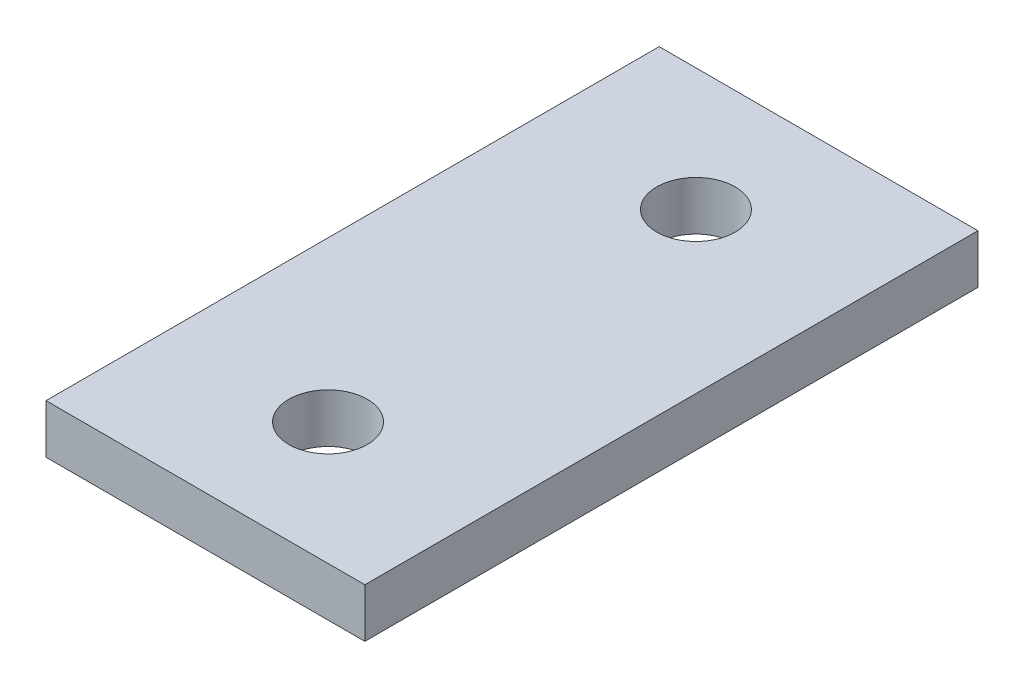
ISO-10303-21;
HEADER;
FILE_DESCRIPTION(('STEP AP214'),'2;1');
FILE_NAME('part.step','',(''),(''),'','','');
FILE_SCHEMA(('AUTOMOTIVE_DESIGN { 1 0 10303 214 1 1 1 1 }'));
ENDSEC;
DATA;
#1=APPLICATION_CONTEXT('core data for automotive mechanical design processes');
#2=APPLICATION_PROTOCOL_DEFINITION('international standard','automotive_design',2000,#1);
#3=PRODUCT_CONTEXT('',#1,'mechanical');
#4=PRODUCT('Part','Part','',(#3));
#5=PRODUCT_RELATED_PRODUCT_CATEGORY('part','',(#4));
#6=PRODUCT_DEFINITION_FORMATION('','',#4);
#7=PRODUCT_DEFINITION_CONTEXT('part definition',#1,'design');
#8=PRODUCT_DEFINITION('design','',#6,#7);
#9=PRODUCT_DEFINITION_SHAPE('','',#8);
#10=(LENGTH_UNIT() NAMED_UNIT(*) SI_UNIT(.MILLI.,.METRE.));
#11=(NAMED_UNIT(*) PLANE_ANGLE_UNIT() SI_UNIT($,.RADIAN.));
#12=(NAMED_UNIT(*) SI_UNIT($,.STERADIAN.) SOLID_ANGLE_UNIT());
#13=UNCERTAINTY_MEASURE_WITH_UNIT(LENGTH_MEASURE(1.E-05),#10,'distance_accuracy_value','');
#14=(GEOMETRIC_REPRESENTATION_CONTEXT(3) GLOBAL_UNCERTAINTY_ASSIGNED_CONTEXT((#13)) GLOBAL_UNIT_ASSIGNED_CONTEXT((#10,
#11,#12)) REPRESENTATION_CONTEXT('',''));
#15=CARTESIAN_POINT('',(0.,0.,0.));
#16=DIRECTION('',(0.,0.,1.));
#17=DIRECTION('',(1.,0.,0.));
#18=AXIS2_PLACEMENT_3D('',#15,#16,#17);
#19=CARTESIAN_POINT('',(0.,2.,0.));
#20=DIRECTION('',(0.,-1.,0.));
#21=DIRECTION('',(0.,0.,-1.));
#22=AXIS2_PLACEMENT_3D('',#19,#20,#21);
#23=PLANE('',#22);
#24=CARTESIAN_POINT('',(0.,2.,-7.5));
#25=DIRECTION('',(0.,1.,0.));
#26=DIRECTION('',(0.,0.,1.));
#27=AXIS2_PLACEMENT_3D('',#24,#25,#26);
#28=CIRCLE('',#27,1.6);
#29=CARTESIAN_POINT('',(0.,2.,-5.9));
#30=VERTEX_POINT('',#29);
#31=EDGE_CURVE('E101',#30,#30,#28,.T.);
#32=ORIENTED_EDGE('',*,*,#31,.F.);
#33=EDGE_LOOP('',(#32));
#34=FACE_BOUND('',#33,.T.);
#35=DIRECTION('',(0.,0.,-1.));
#36=VECTOR('',#35,1.);
#37=CARTESIAN_POINT('',(6.50000000000001,2.,12.5));
#38=LINE('',#37,#36);
#39=CARTESIAN_POINT('',(6.50000000000001,2.,12.5));
#40=VERTEX_POINT('',#39);
#41=CARTESIAN_POINT('',(6.5,2.,-12.5));
#42=VERTEX_POINT('',#41);
#43=EDGE_CURVE('E86',#40,#42,#38,.T.);
#44=ORIENTED_EDGE('',*,*,#43,.T.);
#45=DIRECTION('',(-1.,0.,0.));
#46=VECTOR('',#45,1.);
#47=CARTESIAN_POINT('',(-6.5,2.,-12.5));
#48=LINE('',#47,#46);
#49=CARTESIAN_POINT('',(-6.5,2.,-12.5));
#50=VERTEX_POINT('',#49);
#51=EDGE_CURVE('E81',#42,#50,#48,.T.);
#52=ORIENTED_EDGE('',*,*,#51,.T.);
#53=DIRECTION('',(0.,0.,1.));
#54=VECTOR('',#53,1.);
#55=CARTESIAN_POINT('',(-6.5,2.,12.5));
#56=LINE('',#55,#54);
#57=CARTESIAN_POINT('',(-6.5,2.,12.5));
#58=VERTEX_POINT('',#57);
#59=EDGE_CURVE('E84',#50,#58,#56,.T.);
#60=ORIENTED_EDGE('',*,*,#59,.T.);
#61=DIRECTION('',(1.,0.,0.));
#62=VECTOR('',#61,1.);
#63=CARTESIAN_POINT('',(-6.5,2.,12.5));
#64=LINE('',#63,#62);
#65=EDGE_CURVE('E51',#58,#40,#64,.T.);
#66=ORIENTED_EDGE('',*,*,#65,.T.);
#67=EDGE_LOOP('',(#44,#52,#60,#66));
#68=FACE_BOUND('',#67,.T.);
#69=CARTESIAN_POINT('',(0.,2.,7.5));
#70=DIRECTION('',(0.,1.,0.));
#71=DIRECTION('',(0.,0.,1.));
#72=AXIS2_PLACEMENT_3D('',#69,#70,#71);
#73=CIRCLE('',#72,1.6);
#74=CARTESIAN_POINT('',(0.,2.,9.1));
#75=VERTEX_POINT('',#74);
#76=EDGE_CURVE('E116',#75,#75,#73,.T.);
#77=ORIENTED_EDGE('',*,*,#76,.F.);
#78=EDGE_LOOP('',(#77));
#79=FACE_BOUND('',#78,.T.);
#80=ADVANCED_FACE('F34',(#34,#68,#79),#23,.F.);
#81=CARTESIAN_POINT('',(0.,0.,0.));
#82=DIRECTION('',(0.,-1.,0.));
#83=DIRECTION('',(0.,0.,-1.));
#84=AXIS2_PLACEMENT_3D('',#81,#82,#83);
#85=PLANE('',#84);
#86=CARTESIAN_POINT('',(0.,0.,-7.5));
#87=DIRECTION('',(0.,1.,0.));
#88=DIRECTION('',(0.,0.,1.));
#89=AXIS2_PLACEMENT_3D('',#86,#87,#88);
#90=CIRCLE('',#89,1.6);
#91=CARTESIAN_POINT('',(0.,0.,-5.9));
#92=VERTEX_POINT('',#91);
#93=EDGE_CURVE('E113',#92,#92,#90,.T.);
#94=ORIENTED_EDGE('',*,*,#93,.T.);
#95=EDGE_LOOP('',(#94));
#96=FACE_BOUND('',#95,.T.);
#97=DIRECTION('',(0.,0.,-1.));
#98=VECTOR('',#97,1.);
#99=CARTESIAN_POINT('',(6.50000000000001,0.,12.5));
#100=LINE('',#99,#98);
#101=CARTESIAN_POINT('',(6.50000000000001,0.,12.5));
#102=VERTEX_POINT('',#101);
#103=CARTESIAN_POINT('',(6.5,0.,-12.5));
#104=VERTEX_POINT('',#103);
#105=EDGE_CURVE('E98',#102,#104,#100,.T.);
#106=ORIENTED_EDGE('',*,*,#105,.F.);
#107=DIRECTION('',(1.,0.,0.));
#108=VECTOR('',#107,1.);
#109=CARTESIAN_POINT('',(-6.5,0.,12.5));
#110=LINE('',#109,#108);
#111=CARTESIAN_POINT('',(-6.5,0.,12.5));
#112=VERTEX_POINT('',#111);
#113=EDGE_CURVE('E74',#112,#102,#110,.T.);
#114=ORIENTED_EDGE('',*,*,#113,.F.);
#115=DIRECTION('',(0.,0.,1.));
#116=VECTOR('',#115,1.);
#117=CARTESIAN_POINT('',(-6.5,0.,12.5));
#118=LINE('',#117,#116);
#119=CARTESIAN_POINT('',(-6.5,0.,-12.5));
#120=VERTEX_POINT('',#119);
#121=EDGE_CURVE('E68',#120,#112,#118,.T.);
#122=ORIENTED_EDGE('',*,*,#121,.F.);
#123=DIRECTION('',(-1.,0.,0.));
#124=VECTOR('',#123,1.);
#125=CARTESIAN_POINT('',(-6.5,0.,-12.5));
#126=LINE('',#125,#124);
#127=EDGE_CURVE('E90',#104,#120,#126,.T.);
#128=ORIENTED_EDGE('',*,*,#127,.F.);
#129=EDGE_LOOP('',(#106,#114,#122,#128));
#130=FACE_BOUND('',#129,.T.);
#131=CARTESIAN_POINT('',(0.,0.,7.5));
#132=DIRECTION('',(0.,1.,0.));
#133=DIRECTION('',(0.,0.,1.));
#134=AXIS2_PLACEMENT_3D('',#131,#132,#133);
#135=CIRCLE('',#134,1.6);
#136=CARTESIAN_POINT('',(0.,0.,9.1));
#137=VERTEX_POINT('',#136);
#138=EDGE_CURVE('E119',#137,#137,#135,.T.);
#139=ORIENTED_EDGE('',*,*,#138,.T.);
#140=EDGE_LOOP('',(#139));
#141=FACE_BOUND('',#140,.T.);
#142=ADVANCED_FACE('F109',(#96,#130,#141),#85,.T.);
#143=CARTESIAN_POINT('',(6.50000000000001,2.,12.5));
#144=DIRECTION('',(-1.,0.,0.));
#145=DIRECTION('',(0.,0.,1.));
#146=AXIS2_PLACEMENT_3D('',#143,#144,#145);
#147=PLANE('',#146);
#148=ORIENTED_EDGE('',*,*,#105,.T.);
#149=DIRECTION('',(0.,-1.,0.));
#150=VECTOR('',#149,1.);
#151=CARTESIAN_POINT('',(6.5,2.,-12.5));
#152=LINE('',#151,#150);
#153=EDGE_CURVE('E11',#42,#104,#152,.T.);
#154=ORIENTED_EDGE('',*,*,#153,.F.);
#155=ORIENTED_EDGE('',*,*,#43,.F.);
#156=DIRECTION('',(0.,-1.,0.));
#157=VECTOR('',#156,1.);
#158=CARTESIAN_POINT('',(6.50000000000001,2.,12.5));
#159=LINE('',#158,#157);
#160=EDGE_CURVE('E94',#40,#102,#159,.T.);
#161=ORIENTED_EDGE('',*,*,#160,.T.);
#162=EDGE_LOOP('',(#148,#154,#155,#161));
#163=FACE_BOUND('',#162,.T.);
#164=ADVANCED_FACE('F36',(#163),#147,.F.);
#165=CARTESIAN_POINT('',(-6.5,2.,-12.5));
#166=DIRECTION('',(0.,0.,1.));
#167=DIRECTION('',(1.,0.,0.));
#168=AXIS2_PLACEMENT_3D('',#165,#166,#167);
#169=PLANE('',#168);
#170=ORIENTED_EDGE('',*,*,#127,.T.);
#171=DIRECTION('',(0.,-1.,0.));
#172=VECTOR('',#171,1.);
#173=CARTESIAN_POINT('',(-6.5,2.,-12.5));
#174=LINE('',#173,#172);
#175=EDGE_CURVE('E43',#50,#120,#174,.T.);
#176=ORIENTED_EDGE('',*,*,#175,.F.);
#177=ORIENTED_EDGE('',*,*,#51,.F.);
#178=ORIENTED_EDGE('',*,*,#153,.T.);
#179=EDGE_LOOP('',(#170,#176,#177,#178));
#180=FACE_BOUND('',#179,.T.);
#181=ADVANCED_FACE('F89',(#180),#169,.F.);
#182=CARTESIAN_POINT('',(-6.5,2.,12.5));
#183=DIRECTION('',(1.,0.,0.));
#184=DIRECTION('',(0.,0.,-1.));
#185=AXIS2_PLACEMENT_3D('',#182,#183,#184);
#186=PLANE('',#185);
#187=ORIENTED_EDGE('',*,*,#121,.T.);
#188=DIRECTION('',(0.,-1.,0.));
#189=VECTOR('',#188,1.);
#190=CARTESIAN_POINT('',(-6.5,2.,12.5));
#191=LINE('',#190,#189);
#192=EDGE_CURVE('E91',#58,#112,#191,.T.);
#193=ORIENTED_EDGE('',*,*,#192,.F.);
#194=ORIENTED_EDGE('',*,*,#59,.F.);
#195=ORIENTED_EDGE('',*,*,#175,.T.);
#196=EDGE_LOOP('',(#187,#193,#194,#195));
#197=FACE_BOUND('',#196,.T.);
#198=ADVANCED_FACE('F92',(#197),#186,.F.);
#199=CARTESIAN_POINT('',(-6.5,2.,12.5));
#200=DIRECTION('',(0.,0.,-1.));
#201=DIRECTION('',(-1.,0.,0.));
#202=AXIS2_PLACEMENT_3D('',#199,#200,#201);
#203=PLANE('',#202);
#204=ORIENTED_EDGE('',*,*,#113,.T.);
#205=ORIENTED_EDGE('',*,*,#160,.F.);
#206=ORIENTED_EDGE('',*,*,#65,.F.);
#207=ORIENTED_EDGE('',*,*,#192,.T.);
#208=EDGE_LOOP('',(#204,#205,#206,#207));
#209=FACE_BOUND('',#208,.T.);
#210=ADVANCED_FACE('F106',(#209),#203,.F.);
#211=CARTESIAN_POINT('',(0.,2.,-7.5));
#212=DIRECTION('',(0.,-1.,0.));
#213=DIRECTION('',(0.,0.,-1.));
#214=AXIS2_PLACEMENT_3D('',#211,#212,#213);
#215=CYLINDRICAL_SURFACE('',#214,1.6);
#216=ORIENTED_EDGE('',*,*,#31,.T.);
#217=EDGE_LOOP('',(#216));
#218=FACE_BOUND('',#217,.T.);
#219=ORIENTED_EDGE('',*,*,#93,.F.);
#220=EDGE_LOOP('',(#219));
#221=FACE_BOUND('',#220,.T.);
#222=ADVANCED_FACE('F137',(#218,#221),#215,.F.);
#223=CARTESIAN_POINT('',(0.,2.,7.5));
#224=DIRECTION('',(0.,-1.,0.));
#225=DIRECTION('',(0.,0.,-1.));
#226=AXIS2_PLACEMENT_3D('',#223,#224,#225);
#227=CYLINDRICAL_SURFACE('',#226,1.6);
#228=ORIENTED_EDGE('',*,*,#76,.T.);
#229=EDGE_LOOP('',(#228));
#230=FACE_BOUND('',#229,.T.);
#231=ORIENTED_EDGE('',*,*,#138,.F.);
#232=EDGE_LOOP('',(#231));
#233=FACE_BOUND('',#232,.T.);
#234=ADVANCED_FACE('F125',(#230,#233),#227,.F.);
#235=CLOSED_SHELL('',(#80,#142,#164,#181,#198,#210,#222,#234));
#236=MANIFOLD_SOLID_BREP('B2',#235);
#237=ADVANCED_BREP_SHAPE_REPRESENTATION('',(#18,#236),#14);
#238=SHAPE_DEFINITION_REPRESENTATION(#9,#237);
ENDSEC;
END-ISO-10303-21;
